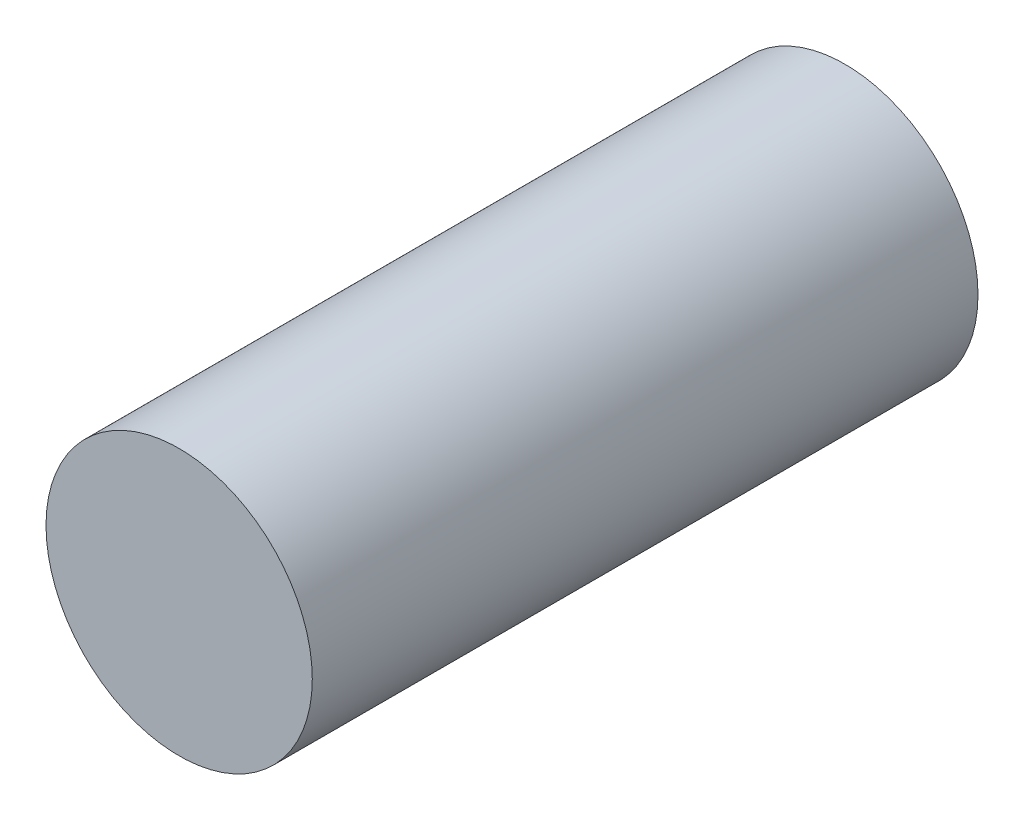
ISO-10303-21;
HEADER;
FILE_DESCRIPTION(('STEP AP214'),'2;1');
FILE_NAME('part.step','',(''),(''),'','','');
FILE_SCHEMA(('AUTOMOTIVE_DESIGN { 1 0 10303 214 1 1 1 1 }'));
ENDSEC;
DATA;
#1=APPLICATION_CONTEXT('core data for automotive mechanical design processes');
#2=APPLICATION_PROTOCOL_DEFINITION('international standard','automotive_design',2000,#1);
#3=PRODUCT_CONTEXT('',#1,'mechanical');
#4=PRODUCT('Part','Part','',(#3));
#5=PRODUCT_RELATED_PRODUCT_CATEGORY('part','',(#4));
#6=PRODUCT_DEFINITION_FORMATION('','',#4);
#7=PRODUCT_DEFINITION_CONTEXT('part definition',#1,'design');
#8=PRODUCT_DEFINITION('design','',#6,#7);
#9=PRODUCT_DEFINITION_SHAPE('','',#8);
#10=(LENGTH_UNIT() NAMED_UNIT(*) SI_UNIT(.MILLI.,.METRE.));
#11=(NAMED_UNIT(*) PLANE_ANGLE_UNIT() SI_UNIT($,.RADIAN.));
#12=(NAMED_UNIT(*) SI_UNIT($,.STERADIAN.) SOLID_ANGLE_UNIT());
#13=UNCERTAINTY_MEASURE_WITH_UNIT(LENGTH_MEASURE(1.E-05),#10,'distance_accuracy_value','');
#14=(GEOMETRIC_REPRESENTATION_CONTEXT(3) GLOBAL_UNCERTAINTY_ASSIGNED_CONTEXT((#13)) GLOBAL_UNIT_ASSIGNED_CONTEXT((#10,
#11,#12)) REPRESENTATION_CONTEXT('',''));
#15=CARTESIAN_POINT('',(0.,0.,0.));
#16=DIRECTION('',(0.,0.,1.));
#17=DIRECTION('',(1.,0.,0.));
#18=AXIS2_PLACEMENT_3D('',#15,#16,#17);
#19=CARTESIAN_POINT('',(0.,0.,10.));
#20=DIRECTION('',(0.,0.,-1.));
#21=DIRECTION('',(-1.,0.,0.));
#22=AXIS2_PLACEMENT_3D('',#19,#20,#21);
#23=CYLINDRICAL_SURFACE('',#22,2.);
#24=CARTESIAN_POINT('',(0.,0.,10.));
#25=DIRECTION('',(0.,0.,1.));
#26=DIRECTION('',(1.,0.,0.));
#27=AXIS2_PLACEMENT_3D('',#24,#25,#26);
#28=CIRCLE('',#27,2.);
#29=CARTESIAN_POINT('',(2.,0.,10.));
#30=VERTEX_POINT('',#29);
#31=EDGE_CURVE('E10',#30,#30,#28,.T.);
#32=ORIENTED_EDGE('',*,*,#31,.F.);
#33=EDGE_LOOP('',(#32));
#34=FACE_BOUND('',#33,.T.);
#35=CARTESIAN_POINT('',(0.,0.,0.));
#36=DIRECTION('',(0.,0.,1.));
#37=DIRECTION('',(1.,0.,0.));
#38=AXIS2_PLACEMENT_3D('',#35,#36,#37);
#39=CIRCLE('',#38,2.);
#40=CARTESIAN_POINT('',(2.,0.,0.));
#41=VERTEX_POINT('',#40);
#42=EDGE_CURVE('E46',#41,#41,#39,.T.);
#43=ORIENTED_EDGE('',*,*,#42,.T.);
#44=EDGE_LOOP('',(#43));
#45=FACE_BOUND('',#44,.T.);
#46=ADVANCED_FACE('F43',(#34,#45),#23,.T.);
#47=CARTESIAN_POINT('',(0.,0.,10.));
#48=DIRECTION('',(0.,0.,1.));
#49=DIRECTION('',(1.,0.,0.));
#50=AXIS2_PLACEMENT_3D('',#47,#48,#49);
#51=PLANE('',#50);
#52=ORIENTED_EDGE('',*,*,#31,.T.);
#53=EDGE_LOOP('',(#52));
#54=FACE_BOUND('',#53,.T.);
#55=ADVANCED_FACE('F60',(#54),#51,.T.);
#56=CARTESIAN_POINT('',(0.,0.,0.));
#57=DIRECTION('',(0.,0.,1.));
#58=DIRECTION('',(1.,0.,0.));
#59=AXIS2_PLACEMENT_3D('',#56,#57,#58);
#60=PLANE('',#59);
#61=ORIENTED_EDGE('',*,*,#42,.F.);
#62=EDGE_LOOP('',(#61));
#63=FACE_BOUND('',#62,.T.);
#64=ADVANCED_FACE('F58',(#63),#60,.F.);
#65=CLOSED_SHELL('',(#46,#55,#64));
#66=MANIFOLD_SOLID_BREP('B2',#65);
#67=ADVANCED_BREP_SHAPE_REPRESENTATION('',(#18,#66),#14);
#68=SHAPE_DEFINITION_REPRESENTATION(#9,#67);
ENDSEC;
END-ISO-10303-21;
